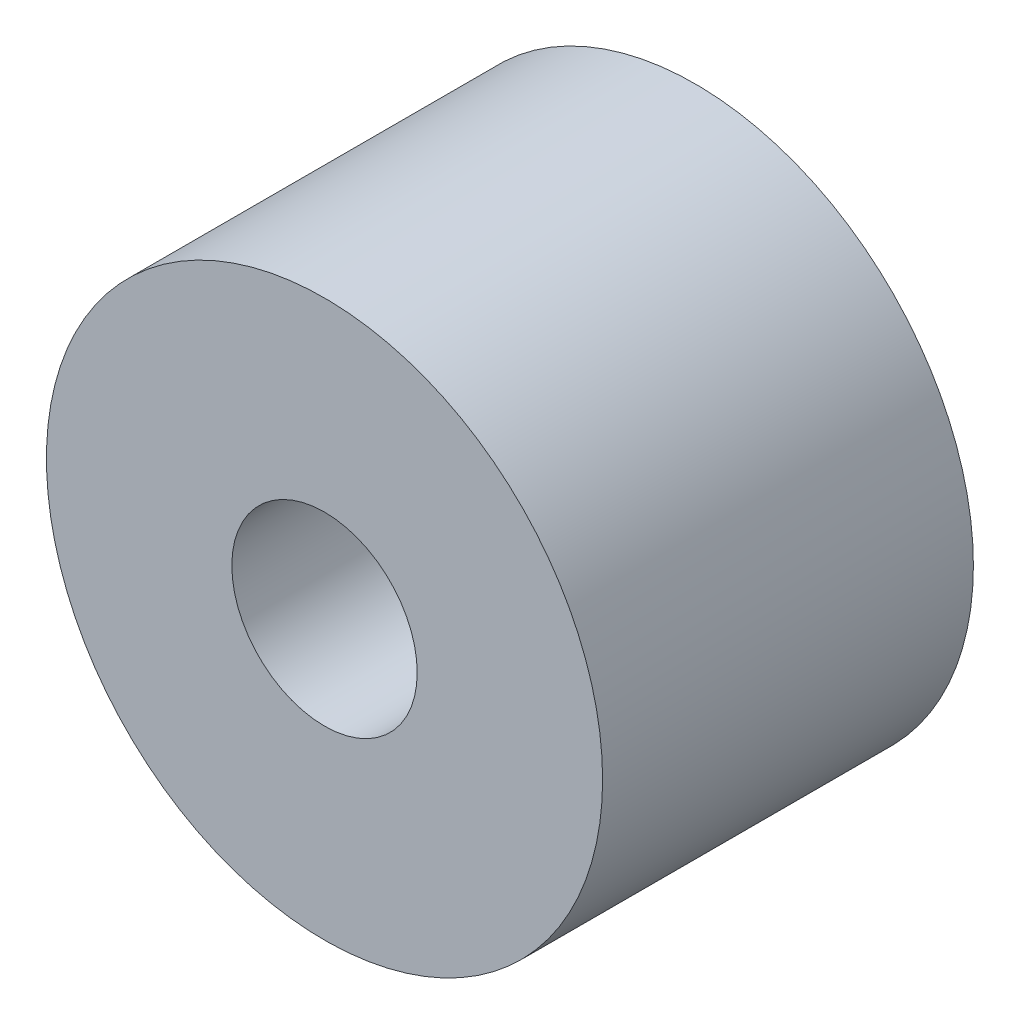
ISO-10303-21;
HEADER;
FILE_DESCRIPTION(('STEP AP214'),'2;1');
FILE_NAME('part.step','',(''),(''),'','','');
FILE_SCHEMA(('AUTOMOTIVE_DESIGN { 1 0 10303 214 1 1 1 1 }'));
ENDSEC;
DATA;
#1=APPLICATION_CONTEXT('core data for automotive mechanical design processes');
#2=APPLICATION_PROTOCOL_DEFINITION('international standard','automotive_design',2000,#1);
#3=PRODUCT_CONTEXT('',#1,'mechanical');
#4=PRODUCT('Part','Part','',(#3));
#5=PRODUCT_RELATED_PRODUCT_CATEGORY('part','',(#4));
#6=PRODUCT_DEFINITION_FORMATION('','',#4);
#7=PRODUCT_DEFINITION_CONTEXT('part definition',#1,'design');
#8=PRODUCT_DEFINITION('design','',#6,#7);
#9=PRODUCT_DEFINITION_SHAPE('','',#8);
#10=(LENGTH_UNIT() NAMED_UNIT(*) SI_UNIT(.MILLI.,.METRE.));
#11=(NAMED_UNIT(*) PLANE_ANGLE_UNIT() SI_UNIT($,.RADIAN.));
#12=(NAMED_UNIT(*) SI_UNIT($,.STERADIAN.) SOLID_ANGLE_UNIT());
#13=UNCERTAINTY_MEASURE_WITH_UNIT(LENGTH_MEASURE(1.E-05),#10,'distance_accuracy_value','');
#14=(GEOMETRIC_REPRESENTATION_CONTEXT(3) GLOBAL_UNCERTAINTY_ASSIGNED_CONTEXT((#13)) GLOBAL_UNIT_ASSIGNED_CONTEXT((#10,
#11,#12)) REPRESENTATION_CONTEXT('',''));
#15=CARTESIAN_POINT('',(0.,0.,0.));
#16=DIRECTION('',(0.,0.,1.));
#17=DIRECTION('',(1.,0.,0.));
#18=AXIS2_PLACEMENT_3D('',#15,#16,#17);
#19=CARTESIAN_POINT('',(0.,0.,50.));
#20=DIRECTION('',(0.,0.,1.));
#21=DIRECTION('',(1.,0.,0.));
#22=AXIS2_PLACEMENT_3D('',#19,#20,#21);
#23=CYLINDRICAL_SURFACE('',#22,15.);
#24=CARTESIAN_POINT('',(0.,0.,50.));
#25=DIRECTION('',(0.,0.,1.));
#26=DIRECTION('',(1.,0.,0.));
#27=AXIS2_PLACEMENT_3D('',#24,#25,#26);
#28=CIRCLE('',#27,15.);
#29=CARTESIAN_POINT('',(15.,0.,50.));
#30=VERTEX_POINT('',#29);
#31=EDGE_CURVE('E10',#30,#30,#28,.T.);
#32=ORIENTED_EDGE('',*,*,#31,.T.);
#33=EDGE_LOOP('',(#32));
#34=FACE_BOUND('',#33,.T.);
#35=CARTESIAN_POINT('',(0.,0.,70.));
#36=DIRECTION('',(0.,0.,1.));
#37=DIRECTION('',(1.,0.,0.));
#38=AXIS2_PLACEMENT_3D('',#35,#36,#37);
#39=CIRCLE('',#38,15.);
#40=CARTESIAN_POINT('',(15.,0.,70.));
#41=VERTEX_POINT('',#40);
#42=EDGE_CURVE('E42',#41,#41,#39,.T.);
#43=ORIENTED_EDGE('',*,*,#42,.F.);
#44=EDGE_LOOP('',(#43));
#45=FACE_BOUND('',#44,.T.);
#46=ADVANCED_FACE('F39',(#34,#45),#23,.T.);
#47=CARTESIAN_POINT('',(0.,0.,50.));
#48=DIRECTION('',(0.,0.,1.));
#49=DIRECTION('',(1.,0.,0.));
#50=AXIS2_PLACEMENT_3D('',#47,#48,#49);
#51=PLANE('',#50);
#52=CARTESIAN_POINT('',(0.,0.,50.));
#53=DIRECTION('',(0.,0.,1.));
#54=DIRECTION('',(1.,0.,0.));
#55=AXIS2_PLACEMENT_3D('',#52,#53,#54);
#56=CIRCLE('',#55,5.);
#57=CARTESIAN_POINT('',(5.,0.,50.));
#58=VERTEX_POINT('',#57);
#59=EDGE_CURVE('E49',#58,#58,#56,.T.);
#60=ORIENTED_EDGE('',*,*,#59,.T.);
#61=EDGE_LOOP('',(#60));
#62=FACE_BOUND('',#61,.T.);
#63=ORIENTED_EDGE('',*,*,#31,.F.);
#64=EDGE_LOOP('',(#63));
#65=FACE_BOUND('',#64,.T.);
#66=ADVANCED_FACE('F57',(#62,#65),#51,.F.);
#67=CARTESIAN_POINT('',(0.,0.,70.));
#68=DIRECTION('',(0.,0.,1.));
#69=DIRECTION('',(1.,0.,0.));
#70=AXIS2_PLACEMENT_3D('',#67,#68,#69);
#71=PLANE('',#70);
#72=CARTESIAN_POINT('',(0.,0.,70.));
#73=DIRECTION('',(0.,0.,1.));
#74=DIRECTION('',(1.,0.,0.));
#75=AXIS2_PLACEMENT_3D('',#72,#73,#74);
#76=CIRCLE('',#75,5.);
#77=CARTESIAN_POINT('',(5.,0.,70.));
#78=VERTEX_POINT('',#77);
#79=EDGE_CURVE('E51',#78,#78,#76,.T.);
#80=ORIENTED_EDGE('',*,*,#79,.F.);
#81=EDGE_LOOP('',(#80));
#82=FACE_BOUND('',#81,.T.);
#83=ORIENTED_EDGE('',*,*,#42,.T.);
#84=EDGE_LOOP('',(#83));
#85=FACE_BOUND('',#84,.T.);
#86=ADVANCED_FACE('F63',(#82,#85),#71,.T.);
#87=CARTESIAN_POINT('',(0.,0.,50.));
#88=DIRECTION('',(0.,0.,1.));
#89=DIRECTION('',(1.,0.,0.));
#90=AXIS2_PLACEMENT_3D('',#87,#88,#89);
#91=CYLINDRICAL_SURFACE('',#90,5.);
#92=ORIENTED_EDGE('',*,*,#59,.F.);
#93=EDGE_LOOP('',(#92));
#94=FACE_BOUND('',#93,.T.);
#95=ORIENTED_EDGE('',*,*,#79,.T.);
#96=EDGE_LOOP('',(#95));
#97=FACE_BOUND('',#96,.T.);
#98=ADVANCED_FACE('F60',(#94,#97),#91,.F.);
#99=CLOSED_SHELL('',(#46,#66,#86,#98));
#100=MANIFOLD_SOLID_BREP('B2',#99);
#101=ADVANCED_BREP_SHAPE_REPRESENTATION('',(#18,#100),#14);
#102=SHAPE_DEFINITION_REPRESENTATION(#9,#101);
ENDSEC;
END-ISO-10303-21;
